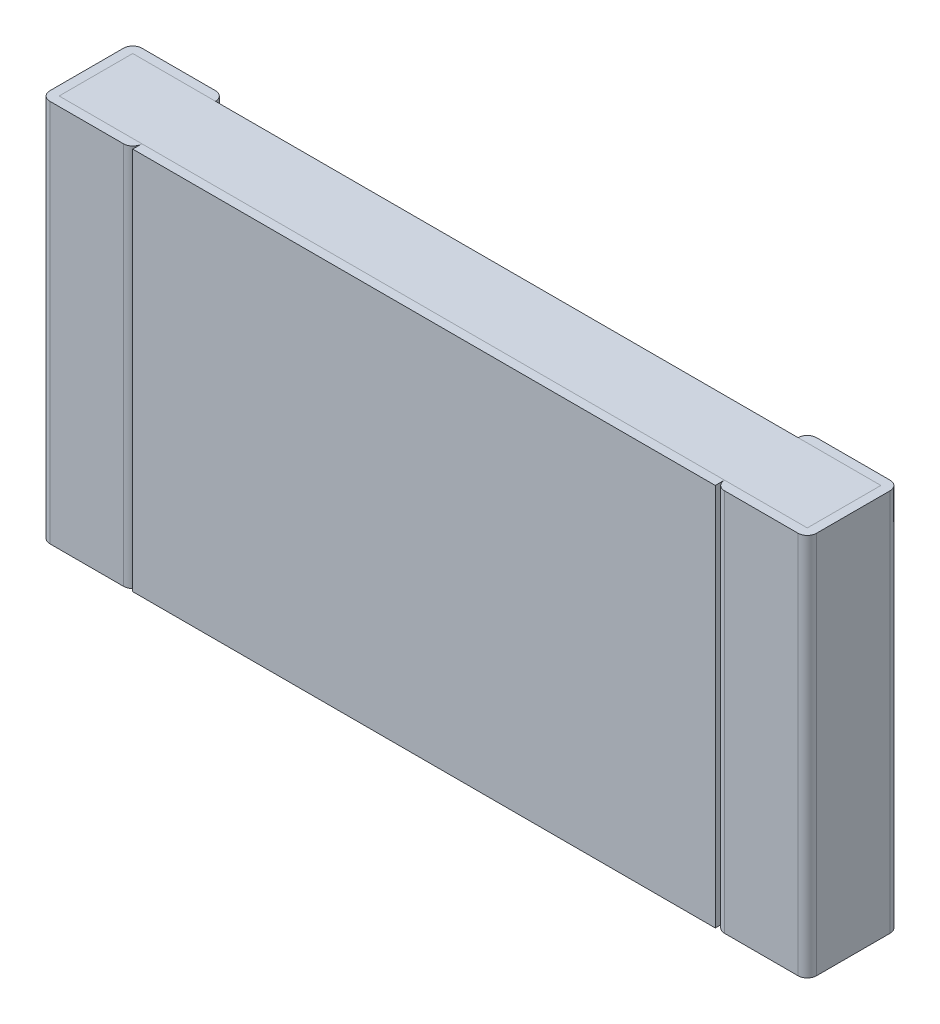
ISO-10303-21;
HEADER;
FILE_DESCRIPTION(('STEP AP214'),'2;1');
FILE_NAME('part.step','',(''),(''),'','','');
FILE_SCHEMA(('AUTOMOTIVE_DESIGN { 1 0 10303 214 1 1 1 1 }'));
ENDSEC;
DATA;
#1=APPLICATION_CONTEXT('core data for automotive mechanical design processes');
#2=APPLICATION_PROTOCOL_DEFINITION('international standard','automotive_design',2000,#1);
#3=PRODUCT_CONTEXT('',#1,'mechanical');
#4=PRODUCT('Part','Part','',(#3));
#5=PRODUCT_RELATED_PRODUCT_CATEGORY('part','',(#4));
#6=PRODUCT_DEFINITION_FORMATION('','',#4);
#7=PRODUCT_DEFINITION_CONTEXT('part definition',#1,'design');
#8=PRODUCT_DEFINITION('design','',#6,#7);
#9=PRODUCT_DEFINITION_SHAPE('','',#8);
#10=(LENGTH_UNIT() NAMED_UNIT(*) SI_UNIT(.MILLI.,.METRE.));
#11=(NAMED_UNIT(*) PLANE_ANGLE_UNIT() SI_UNIT($,.RADIAN.));
#12=(NAMED_UNIT(*) SI_UNIT($,.STERADIAN.) SOLID_ANGLE_UNIT());
#13=UNCERTAINTY_MEASURE_WITH_UNIT(LENGTH_MEASURE(1.E-05),#10,'distance_accuracy_value','');
#14=(GEOMETRIC_REPRESENTATION_CONTEXT(3) GLOBAL_UNCERTAINTY_ASSIGNED_CONTEXT((#13)) GLOBAL_UNIT_ASSIGNED_CONTEXT((#10,
#11,#12)) REPRESENTATION_CONTEXT('',''));
#15=CARTESIAN_POINT('',(0.,0.,0.));
#16=DIRECTION('',(0.,0.,1.));
#17=DIRECTION('',(1.,0.,0.));
#18=AXIS2_PLACEMENT_3D('',#15,#16,#17);
#19=CARTESIAN_POINT('',(-1.9,-1.25,0.6));
#20=DIRECTION('',(0.,0.,1.));
#21=DIRECTION('',(1.,0.,0.));
#22=AXIS2_PLACEMENT_3D('',#19,#20,#21);
#23=PLANE('',#22);
#24=DIRECTION('',(0.,1.,0.));
#25=VECTOR('',#24,1.);
#26=CARTESIAN_POINT('',(-1.9,-1.25,0.6));
#27=LINE('',#26,#25);
#28=CARTESIAN_POINT('',(-1.9,-1.25,0.6));
#29=VERTEX_POINT('',#28);
#30=CARTESIAN_POINT('',(-1.9,1.25,0.6));
#31=VERTEX_POINT('',#30);
#32=EDGE_CURVE('E385',#29,#31,#27,.T.);
#33=ORIENTED_EDGE('',*,*,#32,.F.);
#34=DIRECTION('',(1.,0.,0.));
#35=VECTOR('',#34,1.);
#36=CARTESIAN_POINT('',(-1.9,-1.25,0.6));
#37=LINE('',#36,#35);
#38=CARTESIAN_POINT('',(1.9,-1.25,0.6));
#39=VERTEX_POINT('',#38);
#40=EDGE_CURVE('E309',#29,#39,#37,.T.);
#41=ORIENTED_EDGE('',*,*,#40,.T.);
#42=DIRECTION('',(0.,1.,0.));
#43=VECTOR('',#42,1.);
#44=CARTESIAN_POINT('',(1.9,-1.25,0.6));
#45=LINE('',#44,#43);
#46=CARTESIAN_POINT('',(1.9,1.25,0.6));
#47=VERTEX_POINT('',#46);
#48=EDGE_CURVE('E11',#39,#47,#45,.T.);
#49=ORIENTED_EDGE('',*,*,#48,.T.);
#50=DIRECTION('',(1.,0.,0.));
#51=VECTOR('',#50,1.);
#52=CARTESIAN_POINT('',(-1.9,1.25,0.6));
#53=LINE('',#52,#51);
#54=EDGE_CURVE('E377',#31,#47,#53,.T.);
#55=ORIENTED_EDGE('',*,*,#54,.F.);
#56=EDGE_LOOP('',(#33,#41,#49,#55));
#57=FACE_BOUND('',#56,.T.);
#58=ADVANCED_FACE('F17',(#57),#23,.T.);
#59=CARTESIAN_POINT('',(1.9,-1.25,0.54));
#60=DIRECTION('',(1.,0.,0.));
#61=DIRECTION('',(0.,1.,0.));
#62=AXIS2_PLACEMENT_3D('',#59,#60,#61);
#63=PLANE('',#62);
#64=DIRECTION('',(0.,0.,1.));
#65=VECTOR('',#64,1.);
#66=CARTESIAN_POINT('',(1.9,-1.25,0.54));
#67=LINE('',#66,#65);
#68=CARTESIAN_POINT('',(1.9,-1.25,0.54));
#69=VERTEX_POINT('',#68);
#70=EDGE_CURVE('E313',#69,#39,#67,.T.);
#71=ORIENTED_EDGE('',*,*,#70,.F.);
#72=DIRECTION('',(0.,1.,0.));
#73=VECTOR('',#72,1.);
#74=CARTESIAN_POINT('',(1.9,-1.25,0.54));
#75=LINE('',#74,#73);
#76=CARTESIAN_POINT('',(1.9,1.25,0.54));
#77=VERTEX_POINT('',#76);
#78=EDGE_CURVE('E26',#69,#77,#75,.T.);
#79=ORIENTED_EDGE('',*,*,#78,.T.);
#80=DIRECTION('',(0.,0.,1.));
#81=VECTOR('',#80,1.);
#82=CARTESIAN_POINT('',(1.9,1.25,0.54));
#83=LINE('',#82,#81);
#84=EDGE_CURVE('E418',#77,#47,#83,.T.);
#85=ORIENTED_EDGE('',*,*,#84,.T.);
#86=ORIENTED_EDGE('',*,*,#48,.F.);
#87=EDGE_LOOP('',(#71,#79,#85,#86));
#88=FACE_BOUND('',#87,.T.);
#89=ADVANCED_FACE('F430',(#88),#63,.T.);
#90=CARTESIAN_POINT('',(1.96,-1.25,0.54));
#91=DIRECTION('',(0.,1.,0.));
#92=DIRECTION('',(-1.,0.,0.));
#93=AXIS2_PLACEMENT_3D('',#90,#91,#92);
#94=CYLINDRICAL_SURFACE('',#93,0.06);
#95=CARTESIAN_POINT('',(1.96,-1.25,0.54));
#96=DIRECTION('',(0.,1.,0.));
#97=DIRECTION('',(0.,0.,1.));
#98=AXIS2_PLACEMENT_3D('',#95,#96,#97);
#99=CIRCLE('',#98,0.06);
#100=CARTESIAN_POINT('',(1.96,-1.25,0.6));
#101=VERTEX_POINT('',#100);
#102=EDGE_CURVE('E255',#69,#101,#99,.T.);
#103=ORIENTED_EDGE('',*,*,#102,.T.);
#104=DIRECTION('',(0.,1.,0.));
#105=VECTOR('',#104,1.);
#106=CARTESIAN_POINT('',(1.96,-1.25,0.6));
#107=LINE('',#106,#105);
#108=CARTESIAN_POINT('',(1.96,1.25,0.6));
#109=VERTEX_POINT('',#108);
#110=EDGE_CURVE('E268',#101,#109,#107,.T.);
#111=ORIENTED_EDGE('',*,*,#110,.T.);
#112=CARTESIAN_POINT('',(1.96,1.25,0.54));
#113=DIRECTION('',(0.,1.,0.));
#114=DIRECTION('',(0.,0.,1.));
#115=AXIS2_PLACEMENT_3D('',#112,#113,#114);
#116=CIRCLE('',#115,0.06);
#117=EDGE_CURVE('E404',#77,#109,#116,.T.);
#118=ORIENTED_EDGE('',*,*,#117,.F.);
#119=ORIENTED_EDGE('',*,*,#78,.F.);
#120=EDGE_LOOP('',(#103,#111,#118,#119));
#121=FACE_BOUND('',#120,.T.);
#122=ADVANCED_FACE('F439',(#121),#94,.T.);
#123=CARTESIAN_POINT('',(1.9,-1.25,0.6));
#124=DIRECTION('',(0.,0.,1.));
#125=DIRECTION('',(1.,0.,0.));
#126=AXIS2_PLACEMENT_3D('',#123,#124,#125);
#127=PLANE('',#126);
#128=DIRECTION('',(1.,0.,0.));
#129=VECTOR('',#128,1.);
#130=CARTESIAN_POINT('',(1.9,1.25,0.6));
#131=LINE('',#130,#129);
#132=CARTESIAN_POINT('',(2.44,1.25,0.6));
#133=VERTEX_POINT('',#132);
#134=EDGE_CURVE('E408',#109,#133,#131,.T.);
#135=ORIENTED_EDGE('',*,*,#134,.F.);
#136=ORIENTED_EDGE('',*,*,#110,.F.);
#137=DIRECTION('',(1.,0.,0.));
#138=VECTOR('',#137,1.);
#139=CARTESIAN_POINT('',(1.9,-1.25,0.6));
#140=LINE('',#139,#138);
#141=CARTESIAN_POINT('',(2.44,-1.25,0.6));
#142=VERTEX_POINT('',#141);
#143=EDGE_CURVE('E260',#101,#142,#140,.T.);
#144=ORIENTED_EDGE('',*,*,#143,.T.);
#145=DIRECTION('',(0.,1.,0.));
#146=VECTOR('',#145,1.);
#147=CARTESIAN_POINT('',(2.44,-1.25,0.6));
#148=LINE('',#147,#146);
#149=EDGE_CURVE('E271',#142,#133,#148,.T.);
#150=ORIENTED_EDGE('',*,*,#149,.T.);
#151=EDGE_LOOP('',(#135,#136,#144,#150));
#152=FACE_BOUND('',#151,.T.);
#153=ADVANCED_FACE('F529',(#152),#127,.T.);
#154=CARTESIAN_POINT('',(2.44,-1.25,0.54));
#155=DIRECTION('',(0.,1.,0.));
#156=DIRECTION('',(1.,0.,0.));
#157=AXIS2_PLACEMENT_3D('',#154,#155,#156);
#158=CYLINDRICAL_SURFACE('',#157,0.06);
#159=DIRECTION('',(0.,1.,0.));
#160=VECTOR('',#159,1.);
#161=CARTESIAN_POINT('',(2.5,-1.25,0.54));
#162=LINE('',#161,#160);
#163=CARTESIAN_POINT('',(2.5,-1.25,0.54));
#164=VERTEX_POINT('',#163);
#165=CARTESIAN_POINT('',(2.5,1.25,0.54));
#166=VERTEX_POINT('',#165);
#167=EDGE_CURVE('E386',#164,#166,#162,.T.);
#168=ORIENTED_EDGE('',*,*,#167,.T.);
#169=CARTESIAN_POINT('',(2.44,1.25,0.54));
#170=DIRECTION('',(0.,-1.,0.));
#171=DIRECTION('',(0.,0.,1.));
#172=AXIS2_PLACEMENT_3D('',#169,#170,#171);
#173=CIRCLE('',#172,0.06);
#174=EDGE_CURVE('E412',#166,#133,#173,.T.);
#175=ORIENTED_EDGE('',*,*,#174,.T.);
#176=ORIENTED_EDGE('',*,*,#149,.F.);
#177=CARTESIAN_POINT('',(2.44,-1.25,0.54));
#178=DIRECTION('',(0.,-1.,0.));
#179=DIRECTION('',(0.,0.,1.));
#180=AXIS2_PLACEMENT_3D('',#177,#178,#179);
#181=CIRCLE('',#180,0.06);
#182=EDGE_CURVE('E357',#164,#142,#181,.T.);
#183=ORIENTED_EDGE('',*,*,#182,.F.);
#184=EDGE_LOOP('',(#168,#175,#176,#183));
#185=FACE_BOUND('',#184,.T.);
#186=ADVANCED_FACE('F533',(#185),#158,.T.);
#187=CARTESIAN_POINT('',(2.5,-1.25,0.));
#188=DIRECTION('',(1.,0.,0.));
#189=DIRECTION('',(0.,1.,0.));
#190=AXIS2_PLACEMENT_3D('',#187,#188,#189);
#191=PLANE('',#190);
#192=DIRECTION('',(0.,0.,1.));
#193=VECTOR('',#192,1.);
#194=CARTESIAN_POINT('',(2.5,-1.25,0.));
#195=LINE('',#194,#193);
#196=CARTESIAN_POINT('',(2.5,-1.25,0.06));
#197=VERTEX_POINT('',#196);
#198=EDGE_CURVE('E295',#197,#164,#195,.T.);
#199=ORIENTED_EDGE('',*,*,#198,.F.);
#200=DIRECTION('',(0.,1.,0.));
#201=VECTOR('',#200,1.);
#202=CARTESIAN_POINT('',(2.5,-1.25,0.06));
#203=LINE('',#202,#201);
#204=CARTESIAN_POINT('',(2.5,1.25,0.06));
#205=VERTEX_POINT('',#204);
#206=EDGE_CURVE('E20',#197,#205,#203,.T.);
#207=ORIENTED_EDGE('',*,*,#206,.T.);
#208=DIRECTION('',(0.,0.,1.));
#209=VECTOR('',#208,1.);
#210=CARTESIAN_POINT('',(2.5,1.25,0.));
#211=LINE('',#210,#209);
#212=EDGE_CURVE('E378',#205,#166,#211,.T.);
#213=ORIENTED_EDGE('',*,*,#212,.T.);
#214=ORIENTED_EDGE('',*,*,#167,.F.);
#215=EDGE_LOOP('',(#199,#207,#213,#214));
#216=FACE_BOUND('',#215,.T.);
#217=ADVANCED_FACE('F534',(#216),#191,.T.);
#218=CARTESIAN_POINT('',(2.44,-1.25,0.06));
#219=DIRECTION('',(0.,1.,0.));
#220=DIRECTION('',(1.,0.,0.));
#221=AXIS2_PLACEMENT_3D('',#218,#219,#220);
#222=CYLINDRICAL_SURFACE('',#221,0.06);
#223=CARTESIAN_POINT('',(2.44,-1.25,0.06));
#224=DIRECTION('',(0.,1.,0.));
#225=DIRECTION('',(0.,0.,1.));
#226=AXIS2_PLACEMENT_3D('',#223,#224,#225);
#227=CIRCLE('',#226,0.06);
#228=CARTESIAN_POINT('',(2.44,-1.25,0.));
#229=VERTEX_POINT('',#228);
#230=EDGE_CURVE('E291',#197,#229,#227,.T.);
#231=ORIENTED_EDGE('',*,*,#230,.T.);
#232=DIRECTION('',(0.,1.,0.));
#233=VECTOR('',#232,1.);
#234=CARTESIAN_POINT('',(2.44,-1.25,0.));
#235=LINE('',#234,#233);
#236=CARTESIAN_POINT('',(2.44,1.25,0.));
#237=VERTEX_POINT('',#236);
#238=EDGE_CURVE('E422',#229,#237,#235,.T.);
#239=ORIENTED_EDGE('',*,*,#238,.T.);
#240=CARTESIAN_POINT('',(2.44,1.25,0.06));
#241=DIRECTION('',(0.,1.,0.));
#242=DIRECTION('',(0.,0.,1.));
#243=AXIS2_PLACEMENT_3D('',#240,#241,#242);
#244=CIRCLE('',#243,0.06);
#245=EDGE_CURVE('E373',#205,#237,#244,.T.);
#246=ORIENTED_EDGE('',*,*,#245,.F.);
#247=ORIENTED_EDGE('',*,*,#206,.F.);
#248=EDGE_LOOP('',(#231,#239,#246,#247));
#249=FACE_BOUND('',#248,.T.);
#250=ADVANCED_FACE('F536',(#249),#222,.T.);
#251=CARTESIAN_POINT('',(1.9,-1.25,0.));
#252=DIRECTION('',(0.,0.,1.));
#253=DIRECTION('',(1.,0.,0.));
#254=AXIS2_PLACEMENT_3D('',#251,#252,#253);
#255=PLANE('',#254);
#256=ORIENTED_EDGE('',*,*,#238,.F.);
#257=DIRECTION('',(1.,0.,0.));
#258=VECTOR('',#257,1.);
#259=CARTESIAN_POINT('',(1.9,-1.25,0.));
#260=LINE('',#259,#258);
#261=CARTESIAN_POINT('',(1.96,-1.25,0.));
#262=VERTEX_POINT('',#261);
#263=EDGE_CURVE('E320',#262,#229,#260,.T.);
#264=ORIENTED_EDGE('',*,*,#263,.F.);
#265=DIRECTION('',(0.,1.,0.));
#266=VECTOR('',#265,1.);
#267=CARTESIAN_POINT('',(1.96,-1.25,0.));
#268=LINE('',#267,#266);
#269=CARTESIAN_POINT('',(1.96,1.25,0.));
#270=VERTEX_POINT('',#269);
#271=EDGE_CURVE('E421',#262,#270,#268,.T.);
#272=ORIENTED_EDGE('',*,*,#271,.T.);
#273=DIRECTION('',(1.,0.,0.));
#274=VECTOR('',#273,1.);
#275=CARTESIAN_POINT('',(1.9,1.25,0.));
#276=LINE('',#275,#274);
#277=EDGE_CURVE('E396',#270,#237,#276,.T.);
#278=ORIENTED_EDGE('',*,*,#277,.T.);
#279=EDGE_LOOP('',(#256,#264,#272,#278));
#280=FACE_BOUND('',#279,.T.);
#281=ADVANCED_FACE('F543',(#280),#255,.F.);
#282=CARTESIAN_POINT('',(1.96,-1.25,0.06));
#283=DIRECTION('',(0.,1.,0.));
#284=DIRECTION('',(-1.,0.,0.));
#285=AXIS2_PLACEMENT_3D('',#282,#283,#284);
#286=CYLINDRICAL_SURFACE('',#285,0.06);
#287=DIRECTION('',(0.,1.,0.));
#288=VECTOR('',#287,1.);
#289=CARTESIAN_POINT('',(1.9,-1.25,0.06));
#290=LINE('',#289,#288);
#291=CARTESIAN_POINT('',(1.9,-1.25,0.06));
#292=VERTEX_POINT('',#291);
#293=CARTESIAN_POINT('',(1.9,1.25,0.06));
#294=VERTEX_POINT('',#293);
#295=EDGE_CURVE('E296',#292,#294,#290,.T.);
#296=ORIENTED_EDGE('',*,*,#295,.T.);
#297=CARTESIAN_POINT('',(1.96,1.25,0.06));
#298=DIRECTION('',(0.,-1.,0.));
#299=DIRECTION('',(0.,0.,1.));
#300=AXIS2_PLACEMENT_3D('',#297,#298,#299);
#301=CIRCLE('',#300,0.06);
#302=EDGE_CURVE('E400',#294,#270,#301,.T.);
#303=ORIENTED_EDGE('',*,*,#302,.T.);
#304=ORIENTED_EDGE('',*,*,#271,.F.);
#305=CARTESIAN_POINT('',(1.96,-1.25,0.06));
#306=DIRECTION('',(0.,-1.,0.));
#307=DIRECTION('',(0.,0.,1.));
#308=AXIS2_PLACEMENT_3D('',#305,#306,#307);
#309=CIRCLE('',#308,0.06);
#310=EDGE_CURVE('E259',#292,#262,#309,.T.);
#311=ORIENTED_EDGE('',*,*,#310,.F.);
#312=EDGE_LOOP('',(#296,#303,#304,#311));
#313=FACE_BOUND('',#312,.T.);
#314=ADVANCED_FACE('F595',(#313),#286,.T.);
#315=CARTESIAN_POINT('',(-1.9,1.25,0.54));
#316=DIRECTION('',(0.,1.,0.));
#317=DIRECTION('',(1.,0.,0.));
#318=AXIS2_PLACEMENT_3D('',#315,#316,#317);
#319=PLANE('',#318);
#320=DIRECTION('',(1.,0.,0.));
#321=VECTOR('',#320,1.);
#322=CARTESIAN_POINT('',(-1.9,1.25,0.54));
#323=LINE('',#322,#321);
#324=CARTESIAN_POINT('',(-1.9,1.25,0.54));
#325=VERTEX_POINT('',#324);
#326=EDGE_CURVE('E281',#325,#77,#323,.T.);
#327=ORIENTED_EDGE('',*,*,#326,.F.);
#328=DIRECTION('',(0.,0.,1.));
#329=VECTOR('',#328,1.);
#330=CARTESIAN_POINT('',(-1.9,1.25,0.54));
#331=LINE('',#330,#329);
#332=EDGE_CURVE('E392',#325,#31,#331,.T.);
#333=ORIENTED_EDGE('',*,*,#332,.T.);
#334=ORIENTED_EDGE('',*,*,#54,.T.);
#335=ORIENTED_EDGE('',*,*,#84,.F.);
#336=EDGE_LOOP('',(#327,#333,#334,#335));
#337=FACE_BOUND('',#336,.T.);
#338=ADVANCED_FACE('F437',(#337),#319,.T.);
#339=CARTESIAN_POINT('',(1.9,1.25,0.));
#340=DIRECTION('',(0.,1.,0.));
#341=DIRECTION('',(1.,0.,0.));
#342=AXIS2_PLACEMENT_3D('',#339,#340,#341);
#343=PLANE('',#342);
#344=ORIENTED_EDGE('',*,*,#277,.F.);
#345=ORIENTED_EDGE('',*,*,#302,.F.);
#346=DIRECTION('',(1.,0.,0.));
#347=VECTOR('',#346,1.);
#348=CARTESIAN_POINT('',(-2.44,1.25,0.06));
#349=LINE('',#348,#347);
#350=CARTESIAN_POINT('',(2.44,1.25,0.06));
#351=VERTEX_POINT('',#350);
#352=EDGE_CURVE('E300',#294,#351,#349,.T.);
#353=ORIENTED_EDGE('',*,*,#352,.T.);
#354=DIRECTION('',(0.,0.,1.));
#355=VECTOR('',#354,1.);
#356=CARTESIAN_POINT('',(2.44,1.25,0.06));
#357=LINE('',#356,#355);
#358=CARTESIAN_POINT('',(2.44,1.25,0.54));
#359=VERTEX_POINT('',#358);
#360=EDGE_CURVE('E304',#351,#359,#357,.T.);
#361=ORIENTED_EDGE('',*,*,#360,.T.);
#362=DIRECTION('',(1.,0.,0.));
#363=VECTOR('',#362,1.);
#364=CARTESIAN_POINT('',(-2.44,1.25,0.54));
#365=LINE('',#364,#363);
#366=EDGE_CURVE('E285',#77,#359,#365,.T.);
#367=ORIENTED_EDGE('',*,*,#366,.F.);
#368=ORIENTED_EDGE('',*,*,#117,.T.);
#369=ORIENTED_EDGE('',*,*,#134,.T.);
#370=ORIENTED_EDGE('',*,*,#174,.F.);
#371=ORIENTED_EDGE('',*,*,#212,.F.);
#372=ORIENTED_EDGE('',*,*,#245,.T.);
#373=EDGE_LOOP('',(#344,#345,#353,#361,#367,#368,#369,#370,#371,#372));
#374=FACE_BOUND('',#373,.T.);
#375=ADVANCED_FACE('F444',(#374),#343,.T.);
#376=CARTESIAN_POINT('',(-1.9,-1.25,0.54));
#377=DIRECTION('',(1.,0.,0.));
#378=DIRECTION('',(0.,1.,0.));
#379=AXIS2_PLACEMENT_3D('',#376,#377,#378);
#380=PLANE('',#379);
#381=ORIENTED_EDGE('',*,*,#32,.T.);
#382=ORIENTED_EDGE('',*,*,#332,.F.);
#383=DIRECTION('',(0.,1.,0.));
#384=VECTOR('',#383,1.);
#385=CARTESIAN_POINT('',(-1.9,-1.25,0.54));
#386=LINE('',#385,#384);
#387=CARTESIAN_POINT('',(-1.9,-1.25,0.54));
#388=VERTEX_POINT('',#387);
#389=EDGE_CURVE('E286',#388,#325,#386,.T.);
#390=ORIENTED_EDGE('',*,*,#389,.F.);
#391=DIRECTION('',(0.,0.,1.));
#392=VECTOR('',#391,1.);
#393=CARTESIAN_POINT('',(-1.9,-1.25,0.54));
#394=LINE('',#393,#392);
#395=EDGE_CURVE('E312',#388,#29,#394,.T.);
#396=ORIENTED_EDGE('',*,*,#395,.T.);
#397=EDGE_LOOP('',(#381,#382,#390,#396));
#398=FACE_BOUND('',#397,.T.);
#399=ADVANCED_FACE('F464',(#398),#380,.F.);
#400=CARTESIAN_POINT('',(-1.9,-1.25,0.54));
#401=DIRECTION('',(0.,1.,0.));
#402=DIRECTION('',(1.,0.,0.));
#403=AXIS2_PLACEMENT_3D('',#400,#401,#402);
#404=PLANE('',#403);
#405=ORIENTED_EDGE('',*,*,#70,.T.);
#406=ORIENTED_EDGE('',*,*,#40,.F.);
#407=ORIENTED_EDGE('',*,*,#395,.F.);
#408=DIRECTION('',(1.,0.,0.));
#409=VECTOR('',#408,1.);
#410=CARTESIAN_POINT('',(-1.9,-1.25,0.54));
#411=LINE('',#410,#409);
#412=EDGE_CURVE('E345',#388,#69,#411,.T.);
#413=ORIENTED_EDGE('',*,*,#412,.T.);
#414=EDGE_LOOP('',(#405,#406,#407,#413));
#415=FACE_BOUND('',#414,.T.);
#416=ADVANCED_FACE('F472',(#415),#404,.F.);
#417=CARTESIAN_POINT('',(1.9,-1.25,0.));
#418=DIRECTION('',(0.,1.,0.));
#419=DIRECTION('',(1.,0.,0.));
#420=AXIS2_PLACEMENT_3D('',#417,#418,#419);
#421=PLANE('',#420);
#422=ORIENTED_EDGE('',*,*,#230,.F.);
#423=ORIENTED_EDGE('',*,*,#198,.T.);
#424=ORIENTED_EDGE('',*,*,#182,.T.);
#425=ORIENTED_EDGE('',*,*,#143,.F.);
#426=ORIENTED_EDGE('',*,*,#102,.F.);
#427=DIRECTION('',(1.,0.,0.));
#428=VECTOR('',#427,1.);
#429=CARTESIAN_POINT('',(-2.44,-1.25,0.54));
#430=LINE('',#429,#428);
#431=CARTESIAN_POINT('',(2.44,-1.25,0.54));
#432=VERTEX_POINT('',#431);
#433=EDGE_CURVE('E325',#69,#432,#430,.T.);
#434=ORIENTED_EDGE('',*,*,#433,.T.);
#435=DIRECTION('',(0.,0.,1.));
#436=VECTOR('',#435,1.);
#437=CARTESIAN_POINT('',(2.44,-1.25,0.06));
#438=LINE('',#437,#436);
#439=CARTESIAN_POINT('',(2.44,-1.25,0.06));
#440=VERTEX_POINT('',#439);
#441=EDGE_CURVE('E321',#440,#432,#438,.T.);
#442=ORIENTED_EDGE('',*,*,#441,.F.);
#443=DIRECTION('',(1.,0.,0.));
#444=VECTOR('',#443,1.);
#445=CARTESIAN_POINT('',(-2.44,-1.25,0.06));
#446=LINE('',#445,#444);
#447=EDGE_CURVE('E326',#292,#440,#446,.T.);
#448=ORIENTED_EDGE('',*,*,#447,.F.);
#449=ORIENTED_EDGE('',*,*,#310,.T.);
#450=ORIENTED_EDGE('',*,*,#263,.T.);
#451=EDGE_LOOP('',(#422,#423,#424,#425,#426,#434,#442,#448,#449,#450));
#452=FACE_BOUND('',#451,.T.);
#453=ADVANCED_FACE('F525',(#452),#421,.F.);
#454=CARTESIAN_POINT('',(-2.44,-1.25,0.06));
#455=DIRECTION('',(0.,0.,1.));
#456=DIRECTION('',(1.,0.,0.));
#457=AXIS2_PLACEMENT_3D('',#454,#455,#456);
#458=PLANE('',#457);
#459=DIRECTION('',(1.,0.,0.));
#460=VECTOR('',#459,1.);
#461=CARTESIAN_POINT('',(-2.44,1.25,0.06));
#462=LINE('',#461,#460);
#463=CARTESIAN_POINT('',(-1.9,1.25,0.06));
#464=VERTEX_POINT('',#463);
#465=EDGE_CURVE('E303',#464,#294,#462,.T.);
#466=ORIENTED_EDGE('',*,*,#465,.T.);
#467=ORIENTED_EDGE('',*,*,#295,.F.);
#468=DIRECTION('',(1.,0.,0.));
#469=VECTOR('',#468,1.);
#470=CARTESIAN_POINT('',(-2.44,-1.25,0.06));
#471=LINE('',#470,#469);
#472=CARTESIAN_POINT('',(-1.9,-1.25,0.06));
#473=VERTEX_POINT('',#472);
#474=EDGE_CURVE('E333',#473,#292,#471,.T.);
#475=ORIENTED_EDGE('',*,*,#474,.F.);
#476=DIRECTION('',(0.,1.,0.));
#477=VECTOR('',#476,1.);
#478=CARTESIAN_POINT('',(-1.9,-1.25,0.06));
#479=LINE('',#478,#477);
#480=EDGE_CURVE('E329',#473,#464,#479,.T.);
#481=ORIENTED_EDGE('',*,*,#480,.T.);
#482=EDGE_LOOP('',(#466,#467,#475,#481));
#483=FACE_BOUND('',#482,.T.);
#484=ADVANCED_FACE('F518',(#483),#458,.F.);
#485=CARTESIAN_POINT('',(-2.44,1.25,0.06));
#486=DIRECTION('',(0.,1.,0.));
#487=DIRECTION('',(1.,0.,0.));
#488=AXIS2_PLACEMENT_3D('',#485,#486,#487);
#489=PLANE('',#488);
#490=DIRECTION('',(1.,0.,0.));
#491=VECTOR('',#490,1.);
#492=CARTESIAN_POINT('',(-2.44,1.25,0.06));
#493=LINE('',#492,#491);
#494=CARTESIAN_POINT('',(-2.44,1.25,0.06));
#495=VERTEX_POINT('',#494);
#496=EDGE_CURVE('E299',#495,#464,#493,.T.);
#497=ORIENTED_EDGE('',*,*,#496,.F.);
#498=DIRECTION('',(0.,0.,1.));
#499=VECTOR('',#498,1.);
#500=CARTESIAN_POINT('',(-2.44,1.25,0.06));
#501=LINE('',#500,#499);
#502=CARTESIAN_POINT('',(-2.44,1.25,0.54));
#503=VERTEX_POINT('',#502);
#504=EDGE_CURVE('E290',#495,#503,#501,.T.);
#505=ORIENTED_EDGE('',*,*,#504,.T.);
#506=DIRECTION('',(1.,0.,0.));
#507=VECTOR('',#506,1.);
#508=CARTESIAN_POINT('',(-2.44,1.25,0.54));
#509=LINE('',#508,#507);
#510=EDGE_CURVE('E280',#503,#325,#509,.T.);
#511=ORIENTED_EDGE('',*,*,#510,.T.);
#512=ORIENTED_EDGE('',*,*,#326,.T.);
#513=ORIENTED_EDGE('',*,*,#366,.T.);
#514=ORIENTED_EDGE('',*,*,#360,.F.);
#515=ORIENTED_EDGE('',*,*,#352,.F.);
#516=ORIENTED_EDGE('',*,*,#465,.F.);
#517=EDGE_LOOP('',(#497,#505,#511,#512,#513,#514,#515,#516));
#518=FACE_BOUND('',#517,.T.);
#519=ADVANCED_FACE('F449',(#518),#489,.T.);
#520=CARTESIAN_POINT('',(-1.96,-1.25,0.54));
#521=DIRECTION('',(0.,1.,0.));
#522=DIRECTION('',(1.,0.,0.));
#523=AXIS2_PLACEMENT_3D('',#520,#521,#522);
#524=CYLINDRICAL_SURFACE('',#523,0.06);
#525=ORIENTED_EDGE('',*,*,#389,.T.);
#526=CARTESIAN_POINT('',(-1.96,1.25,0.54));
#527=DIRECTION('',(0.,-1.,0.));
#528=DIRECTION('',(0.,0.,1.));
#529=AXIS2_PLACEMENT_3D('',#526,#527,#528);
#530=CIRCLE('',#529,0.06);
#531=CARTESIAN_POINT('',(-1.96,1.25,0.6));
#532=VERTEX_POINT('',#531);
#533=EDGE_CURVE('E276',#325,#532,#530,.T.);
#534=ORIENTED_EDGE('',*,*,#533,.T.);
#535=DIRECTION('',(0.,1.,0.));
#536=VECTOR('',#535,1.);
#537=CARTESIAN_POINT('',(-1.96,-1.25,0.6));
#538=LINE('',#537,#536);
#539=CARTESIAN_POINT('',(-1.96,-1.25,0.6));
#540=VERTEX_POINT('',#539);
#541=EDGE_CURVE('E349',#540,#532,#538,.T.);
#542=ORIENTED_EDGE('',*,*,#541,.F.);
#543=CARTESIAN_POINT('',(-1.96,-1.25,0.54));
#544=DIRECTION('',(0.,-1.,0.));
#545=DIRECTION('',(0.,0.,1.));
#546=AXIS2_PLACEMENT_3D('',#543,#544,#545);
#547=CIRCLE('',#546,0.06);
#548=EDGE_CURVE('E252',#388,#540,#547,.T.);
#549=ORIENTED_EDGE('',*,*,#548,.F.);
#550=EDGE_LOOP('',(#525,#534,#542,#549));
#551=FACE_BOUND('',#550,.T.);
#552=ADVANCED_FACE('F456',(#551),#524,.T.);
#553=CARTESIAN_POINT('',(-2.5,-1.25,0.6));
#554=DIRECTION('',(0.,0.,1.));
#555=DIRECTION('',(1.,0.,0.));
#556=AXIS2_PLACEMENT_3D('',#553,#554,#555);
#557=PLANE('',#556);
#558=DIRECTION('',(1.,0.,0.));
#559=VECTOR('',#558,1.);
#560=CARTESIAN_POINT('',(-2.5,1.25,0.6));
#561=LINE('',#560,#559);
#562=CARTESIAN_POINT('',(-2.44,1.25,0.6));
#563=VERTEX_POINT('',#562);
#564=EDGE_CURVE('E272',#563,#532,#561,.T.);
#565=ORIENTED_EDGE('',*,*,#564,.F.);
#566=DIRECTION('',(0.,1.,0.));
#567=VECTOR('',#566,1.);
#568=CARTESIAN_POINT('',(-2.44,-1.25,0.6));
#569=LINE('',#568,#567);
#570=CARTESIAN_POINT('',(-2.44,-1.25,0.6));
#571=VERTEX_POINT('',#570);
#572=EDGE_CURVE('E227',#571,#563,#569,.T.);
#573=ORIENTED_EDGE('',*,*,#572,.F.);
#574=DIRECTION('',(1.,0.,0.));
#575=VECTOR('',#574,1.);
#576=CARTESIAN_POINT('',(-2.5,-1.25,0.6));
#577=LINE('',#576,#575);
#578=EDGE_CURVE('E249',#571,#540,#577,.T.);
#579=ORIENTED_EDGE('',*,*,#578,.T.);
#580=ORIENTED_EDGE('',*,*,#541,.T.);
#581=EDGE_LOOP('',(#565,#573,#579,#580));
#582=FACE_BOUND('',#581,.T.);
#583=ADVANCED_FACE('F689',(#582),#557,.T.);
#584=CARTESIAN_POINT('',(-2.44,-1.25,0.06));
#585=DIRECTION('',(0.,1.,0.));
#586=DIRECTION('',(1.,0.,0.));
#587=AXIS2_PLACEMENT_3D('',#584,#585,#586);
#588=PLANE('',#587);
#589=ORIENTED_EDGE('',*,*,#474,.T.);
#590=ORIENTED_EDGE('',*,*,#447,.T.);
#591=ORIENTED_EDGE('',*,*,#441,.T.);
#592=ORIENTED_EDGE('',*,*,#433,.F.);
#593=ORIENTED_EDGE('',*,*,#412,.F.);
#594=DIRECTION('',(1.,0.,0.));
#595=VECTOR('',#594,1.);
#596=CARTESIAN_POINT('',(-2.44,-1.25,0.54));
#597=LINE('',#596,#595);
#598=CARTESIAN_POINT('',(-2.44,-1.25,0.54));
#599=VERTEX_POINT('',#598);
#600=EDGE_CURVE('E469',#599,#388,#597,.T.);
#601=ORIENTED_EDGE('',*,*,#600,.F.);
#602=DIRECTION('',(0.,0.,1.));
#603=VECTOR('',#602,1.);
#604=CARTESIAN_POINT('',(-2.44,-1.25,0.06));
#605=LINE('',#604,#603);
#606=CARTESIAN_POINT('',(-2.44,-1.25,0.06));
#607=VERTEX_POINT('',#606);
#608=EDGE_CURVE('E499',#607,#599,#605,.T.);
#609=ORIENTED_EDGE('',*,*,#608,.F.);
#610=DIRECTION('',(1.,0.,0.));
#611=VECTOR('',#610,1.);
#612=CARTESIAN_POINT('',(-2.44,-1.25,0.06));
#613=LINE('',#612,#611);
#614=EDGE_CURVE('E497',#607,#473,#613,.T.);
#615=ORIENTED_EDGE('',*,*,#614,.T.);
#616=EDGE_LOOP('',(#589,#590,#591,#592,#593,#601,#609,#615));
#617=FACE_BOUND('',#616,.T.);
#618=ADVANCED_FACE('F468',(#617),#588,.F.);
#619=CARTESIAN_POINT('',(-1.96,-1.25,0.06));
#620=DIRECTION('',(0.,1.,0.));
#621=DIRECTION('',(1.,0.,0.));
#622=AXIS2_PLACEMENT_3D('',#619,#620,#621);
#623=CYLINDRICAL_SURFACE('',#622,0.06);
#624=CARTESIAN_POINT('',(-1.96,-1.25,0.06));
#625=DIRECTION('',(0.,1.,0.));
#626=DIRECTION('',(0.,0.,1.));
#627=AXIS2_PLACEMENT_3D('',#624,#625,#626);
#628=CIRCLE('',#627,0.06);
#629=CARTESIAN_POINT('',(-1.96,-1.25,0.));
#630=VERTEX_POINT('',#629);
#631=EDGE_CURVE('E494',#473,#630,#628,.T.);
#632=ORIENTED_EDGE('',*,*,#631,.T.);
#633=DIRECTION('',(0.,1.,0.));
#634=VECTOR('',#633,1.);
#635=CARTESIAN_POINT('',(-1.96,-1.25,0.));
#636=LINE('',#635,#634);
#637=CARTESIAN_POINT('',(-1.96,1.25,0.));
#638=VERTEX_POINT('',#637);
#639=EDGE_CURVE('E232',#630,#638,#636,.T.);
#640=ORIENTED_EDGE('',*,*,#639,.T.);
#641=CARTESIAN_POINT('',(-1.96,1.25,0.06));
#642=DIRECTION('',(0.,1.,0.));
#643=DIRECTION('',(0.,0.,1.));
#644=AXIS2_PLACEMENT_3D('',#641,#642,#643);
#645=CIRCLE('',#644,0.06);
#646=EDGE_CURVE('E308',#464,#638,#645,.T.);
#647=ORIENTED_EDGE('',*,*,#646,.F.);
#648=ORIENTED_EDGE('',*,*,#480,.F.);
#649=EDGE_LOOP('',(#632,#640,#647,#648));
#650=FACE_BOUND('',#649,.T.);
#651=ADVANCED_FACE('F515',(#650),#623,.T.);
#652=CARTESIAN_POINT('',(-2.5,-1.25,0.));
#653=DIRECTION('',(0.,0.,1.));
#654=DIRECTION('',(1.,0.,0.));
#655=AXIS2_PLACEMENT_3D('',#652,#653,#654);
#656=PLANE('',#655);
#657=ORIENTED_EDGE('',*,*,#639,.F.);
#658=DIRECTION('',(1.,0.,0.));
#659=VECTOR('',#658,1.);
#660=CARTESIAN_POINT('',(-2.5,-1.25,0.));
#661=LINE('',#660,#659);
#662=CARTESIAN_POINT('',(-2.44,-1.25,0.));
#663=VERTEX_POINT('',#662);
#664=EDGE_CURVE('E230',#663,#630,#661,.T.);
#665=ORIENTED_EDGE('',*,*,#664,.F.);
#666=DIRECTION('',(0.,1.,0.));
#667=VECTOR('',#666,1.);
#668=CARTESIAN_POINT('',(-2.44,-1.25,0.));
#669=LINE('',#668,#667);
#670=CARTESIAN_POINT('',(-2.44,1.25,0.));
#671=VERTEX_POINT('',#670);
#672=EDGE_CURVE('E216',#663,#671,#669,.T.);
#673=ORIENTED_EDGE('',*,*,#672,.T.);
#674=DIRECTION('',(1.,0.,0.));
#675=VECTOR('',#674,1.);
#676=CARTESIAN_POINT('',(-2.5,1.25,0.));
#677=LINE('',#676,#675);
#678=EDGE_CURVE('E267',#671,#638,#677,.T.);
#679=ORIENTED_EDGE('',*,*,#678,.T.);
#680=EDGE_LOOP('',(#657,#665,#673,#679));
#681=FACE_BOUND('',#680,.T.);
#682=ADVANCED_FACE('F231',(#681),#656,.F.);
#683=CARTESIAN_POINT('',(-2.5,1.25,0.));
#684=DIRECTION('',(0.,1.,0.));
#685=DIRECTION('',(1.,0.,0.));
#686=AXIS2_PLACEMENT_3D('',#683,#684,#685);
#687=PLANE('',#686);
#688=ORIENTED_EDGE('',*,*,#678,.F.);
#689=CARTESIAN_POINT('',(-2.44,1.25,0.06));
#690=DIRECTION('',(0.,-1.,0.));
#691=DIRECTION('',(0.,0.,1.));
#692=AXIS2_PLACEMENT_3D('',#689,#690,#691);
#693=CIRCLE('',#692,0.06);
#694=CARTESIAN_POINT('',(-2.5,1.25,0.06));
#695=VERTEX_POINT('',#694);
#696=EDGE_CURVE('E223',#695,#671,#693,.T.);
#697=ORIENTED_EDGE('',*,*,#696,.F.);
#698=DIRECTION('',(0.,0.,1.));
#699=VECTOR('',#698,1.);
#700=CARTESIAN_POINT('',(-2.5,1.25,0.));
#701=LINE('',#700,#699);
#702=CARTESIAN_POINT('',(-2.5,1.25,0.54));
#703=VERTEX_POINT('',#702);
#704=EDGE_CURVE('E480',#695,#703,#701,.T.);
#705=ORIENTED_EDGE('',*,*,#704,.T.);
#706=CARTESIAN_POINT('',(-2.44,1.25,0.54));
#707=DIRECTION('',(0.,1.,0.));
#708=DIRECTION('',(0.,0.,1.));
#709=AXIS2_PLACEMENT_3D('',#706,#707,#708);
#710=CIRCLE('',#709,0.06);
#711=EDGE_CURVE('E263',#703,#563,#710,.T.);
#712=ORIENTED_EDGE('',*,*,#711,.T.);
#713=ORIENTED_EDGE('',*,*,#564,.T.);
#714=ORIENTED_EDGE('',*,*,#533,.F.);
#715=ORIENTED_EDGE('',*,*,#510,.F.);
#716=ORIENTED_EDGE('',*,*,#504,.F.);
#717=ORIENTED_EDGE('',*,*,#496,.T.);
#718=ORIENTED_EDGE('',*,*,#646,.T.);
#719=EDGE_LOOP('',(#688,#697,#705,#712,#713,#714,#715,#716,#717,#718));
#720=FACE_BOUND('',#719,.T.);
#721=ADVANCED_FACE('F454',(#720),#687,.T.);
#722=CARTESIAN_POINT('',(-2.44,-1.25,0.54));
#723=DIRECTION('',(0.,1.,0.));
#724=DIRECTION('',(-1.,0.,0.));
#725=AXIS2_PLACEMENT_3D('',#722,#723,#724);
#726=CYLINDRICAL_SURFACE('',#725,0.06);
#727=CARTESIAN_POINT('',(-2.44,-1.25,0.54));
#728=DIRECTION('',(0.,1.,0.));
#729=DIRECTION('',(0.,0.,1.));
#730=AXIS2_PLACEMENT_3D('',#727,#728,#729);
#731=CIRCLE('',#730,0.06);
#732=CARTESIAN_POINT('',(-2.5,-1.25,0.54));
#733=VERTEX_POINT('',#732);
#734=EDGE_CURVE('E243',#733,#571,#731,.T.);
#735=ORIENTED_EDGE('',*,*,#734,.T.);
#736=ORIENTED_EDGE('',*,*,#572,.T.);
#737=ORIENTED_EDGE('',*,*,#711,.F.);
#738=DIRECTION('',(0.,1.,0.));
#739=VECTOR('',#738,1.);
#740=CARTESIAN_POINT('',(-2.5,-1.25,0.54));
#741=LINE('',#740,#739);
#742=EDGE_CURVE('E481',#733,#703,#741,.T.);
#743=ORIENTED_EDGE('',*,*,#742,.F.);
#744=EDGE_LOOP('',(#735,#736,#737,#743));
#745=FACE_BOUND('',#744,.T.);
#746=ADVANCED_FACE('F735',(#745),#726,.T.);
#747=CARTESIAN_POINT('',(-2.44,-1.25,0.06));
#748=DIRECTION('',(0.,1.,0.));
#749=DIRECTION('',(-1.,0.,0.));
#750=AXIS2_PLACEMENT_3D('',#747,#748,#749);
#751=CYLINDRICAL_SURFACE('',#750,0.06);
#752=DIRECTION('',(0.,1.,0.));
#753=VECTOR('',#752,1.);
#754=CARTESIAN_POINT('',(-2.5,-1.25,0.06));
#755=LINE('',#754,#753);
#756=CARTESIAN_POINT('',(-2.5,-1.25,0.06));
#757=VERTEX_POINT('',#756);
#758=EDGE_CURVE('E478',#757,#695,#755,.T.);
#759=ORIENTED_EDGE('',*,*,#758,.T.);
#760=ORIENTED_EDGE('',*,*,#696,.T.);
#761=ORIENTED_EDGE('',*,*,#672,.F.);
#762=CARTESIAN_POINT('',(-2.44,-1.25,0.06));
#763=DIRECTION('',(0.,-1.,0.));
#764=DIRECTION('',(0.,0.,1.));
#765=AXIS2_PLACEMENT_3D('',#762,#763,#764);
#766=CIRCLE('',#765,0.06);
#767=EDGE_CURVE('E221',#757,#663,#766,.T.);
#768=ORIENTED_EDGE('',*,*,#767,.F.);
#769=EDGE_LOOP('',(#759,#760,#761,#768));
#770=FACE_BOUND('',#769,.T.);
#771=ADVANCED_FACE('F219',(#770),#751,.T.);
#772=CARTESIAN_POINT('',(-2.5,-1.25,0.));
#773=DIRECTION('',(0.,1.,0.));
#774=DIRECTION('',(1.,0.,0.));
#775=AXIS2_PLACEMENT_3D('',#772,#773,#774);
#776=PLANE('',#775);
#777=ORIENTED_EDGE('',*,*,#631,.F.);
#778=ORIENTED_EDGE('',*,*,#614,.F.);
#779=ORIENTED_EDGE('',*,*,#608,.T.);
#780=ORIENTED_EDGE('',*,*,#600,.T.);
#781=ORIENTED_EDGE('',*,*,#548,.T.);
#782=ORIENTED_EDGE('',*,*,#578,.F.);
#783=ORIENTED_EDGE('',*,*,#734,.F.);
#784=DIRECTION('',(0.,0.,1.));
#785=VECTOR('',#784,1.);
#786=CARTESIAN_POINT('',(-2.5,-1.25,0.));
#787=LINE('',#786,#785);
#788=EDGE_CURVE('E240',#757,#733,#787,.T.);
#789=ORIENTED_EDGE('',*,*,#788,.F.);
#790=ORIENTED_EDGE('',*,*,#767,.T.);
#791=ORIENTED_EDGE('',*,*,#664,.T.);
#792=EDGE_LOOP('',(#777,#778,#779,#780,#781,#782,#783,#789,#790,#791));
#793=FACE_BOUND('',#792,.T.);
#794=ADVANCED_FACE('F238',(#793),#776,.F.);
#795=CARTESIAN_POINT('',(-2.5,-1.25,0.));
#796=DIRECTION('',(1.,0.,0.));
#797=DIRECTION('',(0.,1.,0.));
#798=AXIS2_PLACEMENT_3D('',#795,#796,#797);
#799=PLANE('',#798);
#800=ORIENTED_EDGE('',*,*,#742,.T.);
#801=ORIENTED_EDGE('',*,*,#704,.F.);
#802=ORIENTED_EDGE('',*,*,#758,.F.);
#803=ORIENTED_EDGE('',*,*,#788,.T.);
#804=EDGE_LOOP('',(#800,#801,#802,#803));
#805=FACE_BOUND('',#804,.T.);
#806=ADVANCED_FACE('F761',(#805),#799,.F.);
#807=CLOSED_SHELL('',(#58,#89,#122,#153,#186,#217,#250,#281,#314,#338,#375,#399,#416,#453,#484,
#519,#552,#583,#618,#651,#682,#721,#746,#771,#794,#806));
#808=MANIFOLD_SOLID_BREP('B1',#807);
#809=ADVANCED_BREP_SHAPE_REPRESENTATION('',(#18,#808),#14);
#810=SHAPE_DEFINITION_REPRESENTATION(#9,#809);
ENDSEC;
END-ISO-10303-21;
